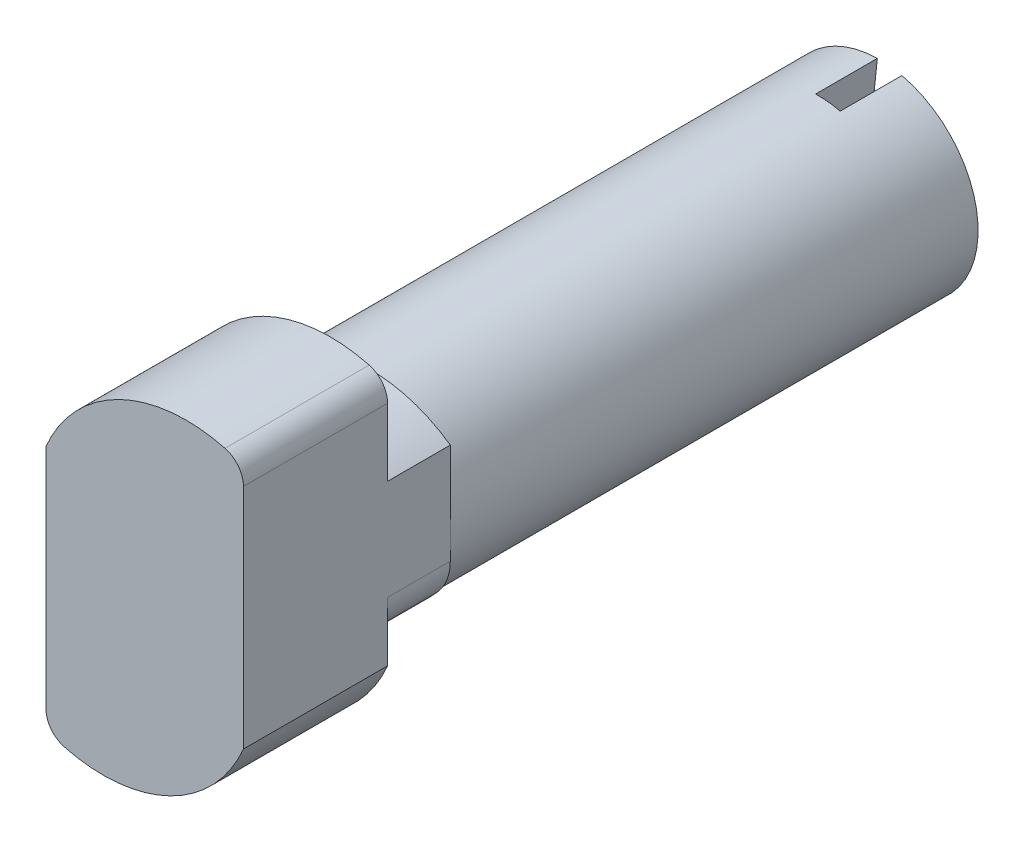
ISO-10303-21;
HEADER;
FILE_DESCRIPTION(('STEP AP214'),'2;1');
FILE_NAME('part.step','',(''),(''),'','','');
FILE_SCHEMA(('AUTOMOTIVE_DESIGN { 1 0 10303 214 1 1 1 1 }'));
ENDSEC;
DATA;
#1=APPLICATION_CONTEXT('core data for automotive mechanical design processes');
#2=APPLICATION_PROTOCOL_DEFINITION('international standard','automotive_design',2000,#1);
#3=PRODUCT_CONTEXT('',#1,'mechanical');
#4=PRODUCT('Part','Part','',(#3));
#5=PRODUCT_RELATED_PRODUCT_CATEGORY('part','',(#4));
#6=PRODUCT_DEFINITION_FORMATION('','',#4);
#7=PRODUCT_DEFINITION_CONTEXT('part definition',#1,'design');
#8=PRODUCT_DEFINITION('design','',#6,#7);
#9=PRODUCT_DEFINITION_SHAPE('','',#8);
#10=(LENGTH_UNIT() NAMED_UNIT(*) SI_UNIT(.MILLI.,.METRE.));
#11=(NAMED_UNIT(*) PLANE_ANGLE_UNIT() SI_UNIT($,.RADIAN.));
#12=(NAMED_UNIT(*) SI_UNIT($,.STERADIAN.) SOLID_ANGLE_UNIT());
#13=UNCERTAINTY_MEASURE_WITH_UNIT(LENGTH_MEASURE(1.E-05),#10,'distance_accuracy_value','');
#14=(GEOMETRIC_REPRESENTATION_CONTEXT(3) GLOBAL_UNCERTAINTY_ASSIGNED_CONTEXT((#13)) GLOBAL_UNIT_ASSIGNED_CONTEXT((#10,
#11,#12)) REPRESENTATION_CONTEXT('',''));
#15=CARTESIAN_POINT('',(0.,0.,0.));
#16=DIRECTION('',(0.,0.,1.));
#17=DIRECTION('',(1.,0.,0.));
#18=AXIS2_PLACEMENT_3D('',#15,#16,#17);
#19=CARTESIAN_POINT('',(1.68648446998917,0.889127393809731,0.));
#20=DIRECTION('',(0.,0.,1.));
#21=DIRECTION('',(1.,0.,0.));
#22=AXIS2_PLACEMENT_3D('',#19,#20,#21);
#23=CYLINDRICAL_SURFACE('',#22,6.18135093134867);
#24=CARTESIAN_POINT('',(1.68648446998917,0.889127393809731,0.));
#25=DIRECTION('',(0.,0.,1.));
#26=DIRECTION('',(1.,0.,0.));
#27=AXIS2_PLACEMENT_3D('',#24,#25,#26);
#28=CIRCLE('',#27,6.18135093134867);
#29=CARTESIAN_POINT('',(3.25350831229432,6.86855342095754,0.));
#30=VERTEX_POINT('',#29);
#31=CARTESIAN_POINT('',(-4.,3.31255342095752,0.));
#32=VERTEX_POINT('',#31);
#33=EDGE_CURVE('E220',#30,#32,#28,.T.);
#34=ORIENTED_EDGE('',*,*,#33,.T.);
#35=DIRECTION('',(0.,0.,1.));
#36=VECTOR('',#35,1.);
#37=CARTESIAN_POINT('',(-4.,3.31255342095755,0.));
#38=LINE('',#37,#36);
#39=CARTESIAN_POINT('',(-4.,3.31255342095752,5.842));
#40=VERTEX_POINT('',#39);
#41=EDGE_CURVE('E141',#40,#32,#38,.F.);
#42=ORIENTED_EDGE('',*,*,#41,.F.);
#43=CARTESIAN_POINT('',(1.68648446998917,0.889127393809731,5.842));
#44=DIRECTION('',(0.,0.,1.));
#45=DIRECTION('',(1.,0.,0.));
#46=AXIS2_PLACEMENT_3D('',#43,#44,#45);
#47=CIRCLE('',#46,6.18135093134867);
#48=CARTESIAN_POINT('',(3.25350831229432,6.86855342095753,5.842));
#49=VERTEX_POINT('',#48);
#50=EDGE_CURVE('E17',#49,#40,#47,.T.);
#51=ORIENTED_EDGE('',*,*,#50,.F.);
#52=DIRECTION('',(0.,0.,1.));
#53=VECTOR('',#52,1.);
#54=CARTESIAN_POINT('',(3.25350831229431,6.86855342095754,0.));
#55=LINE('',#54,#53);
#56=EDGE_CURVE('E138',#30,#49,#55,.T.);
#57=ORIENTED_EDGE('',*,*,#56,.F.);
#58=EDGE_LOOP('',(#34,#42,#51,#57));
#59=FACE_BOUND('',#58,.T.);
#60=ADVANCED_FACE('F14',(#59),#23,.T.);
#61=CARTESIAN_POINT('',(-3.,-5.90122021280345,0.));
#62=DIRECTION('',(0.,0.,1.));
#63=DIRECTION('',(1.,0.,0.));
#64=AXIS2_PLACEMENT_3D('',#61,#62,#63);
#65=CYLINDRICAL_SURFACE('',#64,1.);
#66=CARTESIAN_POINT('',(-3.,-5.90122021280345,0.));
#67=DIRECTION('',(0.,0.,1.));
#68=DIRECTION('',(1.,0.,0.));
#69=AXIS2_PLACEMENT_3D('',#66,#67,#68);
#70=CIRCLE('',#69,1.);
#71=CARTESIAN_POINT('',(-4.,-5.90122021280345,0.));
#72=VERTEX_POINT('',#71);
#73=CARTESIAN_POINT('',(-3.25350831229432,-6.86855342095753,0.));
#74=VERTEX_POINT('',#73);
#75=EDGE_CURVE('E214',#72,#74,#70,.T.);
#76=ORIENTED_EDGE('',*,*,#75,.T.);
#77=DIRECTION('',(0.,0.,1.));
#78=VECTOR('',#77,1.);
#79=CARTESIAN_POINT('',(-3.25350831229432,-6.86855342095751,0.));
#80=LINE('',#79,#78);
#81=CARTESIAN_POINT('',(-3.25350831229432,-6.86855342095753,5.842));
#82=VERTEX_POINT('',#81);
#83=EDGE_CURVE('E154',#82,#74,#80,.F.);
#84=ORIENTED_EDGE('',*,*,#83,.F.);
#85=CARTESIAN_POINT('',(-3.,-5.90122021280345,5.842));
#86=DIRECTION('',(0.,0.,1.));
#87=DIRECTION('',(1.,0.,0.));
#88=AXIS2_PLACEMENT_3D('',#85,#86,#87);
#89=CIRCLE('',#88,1.);
#90=CARTESIAN_POINT('',(-4.,-5.90122021280345,5.842));
#91=VERTEX_POINT('',#90);
#92=EDGE_CURVE('E145',#91,#82,#89,.T.);
#93=ORIENTED_EDGE('',*,*,#92,.F.);
#94=DIRECTION('',(0.,0.,1.));
#95=VECTOR('',#94,1.);
#96=CARTESIAN_POINT('',(-4.,-5.90122021280345,0.));
#97=LINE('',#96,#95);
#98=EDGE_CURVE('E244',#72,#91,#97,.T.);
#99=ORIENTED_EDGE('',*,*,#98,.F.);
#100=EDGE_LOOP('',(#76,#84,#93,#99));
#101=FACE_BOUND('',#100,.T.);
#102=ADVANCED_FACE('F231',(#101),#65,.T.);
#103=CARTESIAN_POINT('',(0.,0.,5.842));
#104=DIRECTION('',(0.,0.,1.));
#105=DIRECTION('',(1.,0.,0.));
#106=AXIS2_PLACEMENT_3D('',#103,#104,#105);
#107=PLANE('',#106);
#108=DIRECTION('',(0.,1.,0.));
#109=VECTOR('',#108,1.);
#110=CARTESIAN_POINT('',(4.,5.90122021280345,5.842));
#111=LINE('',#110,#109);
#112=CARTESIAN_POINT('',(4.,5.90122021280345,5.842));
#113=VERTEX_POINT('',#112);
#114=CARTESIAN_POINT('',(4.,-3.31255342095752,5.842));
#115=VERTEX_POINT('',#114);
#116=EDGE_CURVE('E150',#113,#115,#111,.F.);
#117=ORIENTED_EDGE('',*,*,#116,.F.);
#118=CARTESIAN_POINT('',(3.,5.90122021280345,5.842));
#119=DIRECTION('',(0.,0.,1.));
#120=DIRECTION('',(1.,0.,0.));
#121=AXIS2_PLACEMENT_3D('',#118,#119,#120);
#122=CIRCLE('',#121,1.);
#123=EDGE_CURVE('E147',#49,#113,#122,.F.);
#124=ORIENTED_EDGE('',*,*,#123,.F.);
#125=ORIENTED_EDGE('',*,*,#50,.T.);
#126=DIRECTION('',(0.,1.,0.));
#127=VECTOR('',#126,1.);
#128=CARTESIAN_POINT('',(-4.,-5.90122021280345,5.842));
#129=LINE('',#128,#127);
#130=EDGE_CURVE('E207',#91,#40,#129,.T.);
#131=ORIENTED_EDGE('',*,*,#130,.F.);
#132=ORIENTED_EDGE('',*,*,#92,.T.);
#133=CARTESIAN_POINT('',(-1.68648446998917,-0.889127393809732,5.842));
#134=DIRECTION('',(0.,0.,1.));
#135=DIRECTION('',(1.,0.,0.));
#136=AXIS2_PLACEMENT_3D('',#133,#134,#135);
#137=CIRCLE('',#136,6.18135093134867);
#138=EDGE_CURVE('E223',#115,#82,#137,.F.);
#139=ORIENTED_EDGE('',*,*,#138,.F.);
#140=EDGE_LOOP('',(#117,#124,#125,#131,#132,#139));
#141=FACE_BOUND('',#140,.T.);
#142=ADVANCED_FACE('F148',(#141),#107,.T.);
#143=CARTESIAN_POINT('',(-1.68648446998917,-0.889127393809732,0.));
#144=DIRECTION('',(0.,0.,1.));
#145=DIRECTION('',(1.,0.,0.));
#146=AXIS2_PLACEMENT_3D('',#143,#144,#145);
#147=CYLINDRICAL_SURFACE('',#146,6.18135093134867);
#148=CARTESIAN_POINT('',(-1.68648446998917,-0.889127393809732,0.));
#149=DIRECTION('',(0.,0.,1.));
#150=DIRECTION('',(1.,0.,0.));
#151=AXIS2_PLACEMENT_3D('',#148,#149,#150);
#152=CIRCLE('',#151,6.18135093134867);
#153=CARTESIAN_POINT('',(4.,-3.31255342095752,0.));
#154=VERTEX_POINT('',#153);
#155=EDGE_CURVE('E212',#74,#154,#152,.T.);
#156=ORIENTED_EDGE('',*,*,#155,.T.);
#157=DIRECTION('',(0.,0.,-1.));
#158=VECTOR('',#157,1.);
#159=CARTESIAN_POINT('',(4.,-3.31255342095755,0.));
#160=LINE('',#159,#158);
#161=EDGE_CURVE('E236',#115,#154,#160,.T.);
#162=ORIENTED_EDGE('',*,*,#161,.F.);
#163=ORIENTED_EDGE('',*,*,#138,.T.);
#164=ORIENTED_EDGE('',*,*,#83,.T.);
#165=EDGE_LOOP('',(#156,#162,#163,#164));
#166=FACE_BOUND('',#165,.T.);
#167=ADVANCED_FACE('F234',(#166),#147,.T.);
#168=CARTESIAN_POINT('',(3.,5.90122021280345,0.));
#169=DIRECTION('',(0.,0.,1.));
#170=DIRECTION('',(1.,0.,0.));
#171=AXIS2_PLACEMENT_3D('',#168,#169,#170);
#172=CYLINDRICAL_SURFACE('',#171,1.);
#173=CARTESIAN_POINT('',(3.,5.90122021280345,0.));
#174=DIRECTION('',(0.,0.,1.));
#175=DIRECTION('',(1.,0.,0.));
#176=AXIS2_PLACEMENT_3D('',#173,#174,#175);
#177=CIRCLE('',#176,1.);
#178=CARTESIAN_POINT('',(4.,5.90122021280345,0.));
#179=VERTEX_POINT('',#178);
#180=EDGE_CURVE('E157',#179,#30,#177,.T.);
#181=ORIENTED_EDGE('',*,*,#180,.T.);
#182=ORIENTED_EDGE('',*,*,#56,.T.);
#183=ORIENTED_EDGE('',*,*,#123,.T.);
#184=DIRECTION('',(0.,0.,-1.));
#185=VECTOR('',#184,1.);
#186=CARTESIAN_POINT('',(4.,5.90122021280345,0.));
#187=LINE('',#186,#185);
#188=EDGE_CURVE('E243',#179,#113,#187,.F.);
#189=ORIENTED_EDGE('',*,*,#188,.F.);
#190=EDGE_LOOP('',(#181,#182,#183,#189));
#191=FACE_BOUND('',#190,.T.);
#192=ADVANCED_FACE('F156',(#191),#172,.T.);
#193=CARTESIAN_POINT('',(-2.,0.908968852594026,0.));
#194=DIRECTION('',(0.,0.,-1.));
#195=DIRECTION('',(-1.,0.,0.));
#196=AXIS2_PLACEMENT_3D('',#193,#194,#195);
#197=CYLINDRICAL_SURFACE('',#196,2.);
#198=CARTESIAN_POINT('',(-2.,0.908968852594026,0.));
#199=DIRECTION('',(0.,0.,-1.));
#200=DIRECTION('',(-1.,0.,0.));
#201=AXIS2_PLACEMENT_3D('',#198,#199,#200);
#202=CIRCLE('',#201,2.);
#203=CARTESIAN_POINT('',(-4.,0.908968852594026,0.));
#204=VERTEX_POINT('',#203);
#205=CARTESIAN_POINT('',(-3.52743220326615,2.20007336595672,0.));
#206=VERTEX_POINT('',#205);
#207=EDGE_CURVE('E218',#204,#206,#202,.T.);
#208=ORIENTED_EDGE('',*,*,#207,.T.);
#209=DIRECTION('',(0.,0.,-1.));
#210=VECTOR('',#209,1.);
#211=CARTESIAN_POINT('',(-3.52743220326615,2.20007336595672,0.));
#212=LINE('',#211,#210);
#213=CARTESIAN_POINT('',(-3.52743220326615,2.20007336595672,-2.54));
#214=VERTEX_POINT('',#213);
#215=EDGE_CURVE('E204',#214,#206,#212,.F.);
#216=ORIENTED_EDGE('',*,*,#215,.F.);
#217=CARTESIAN_POINT('',(-2.,0.908968852594026,-2.54));
#218=DIRECTION('',(0.,0.,-1.));
#219=DIRECTION('',(-1.,0.,0.));
#220=AXIS2_PLACEMENT_3D('',#217,#218,#219);
#221=CIRCLE('',#220,2.);
#222=CARTESIAN_POINT('',(-4.,0.908968852594026,-2.54));
#223=VERTEX_POINT('',#222);
#224=EDGE_CURVE('E159',#214,#223,#221,.F.);
#225=ORIENTED_EDGE('',*,*,#224,.T.);
#226=DIRECTION('',(0.,0.,1.));
#227=VECTOR('',#226,1.);
#228=CARTESIAN_POINT('',(-4.,0.908968852594025,0.));
#229=LINE('',#228,#227);
#230=EDGE_CURVE('E250',#204,#223,#229,.F.);
#231=ORIENTED_EDGE('',*,*,#230,.F.);
#232=EDGE_LOOP('',(#208,#216,#225,#231));
#233=FACE_BOUND('',#232,.T.);
#234=ADVANCED_FACE('F320',(#233),#197,.T.);
#235=CARTESIAN_POINT('',(0.,0.,0.));
#236=DIRECTION('',(0.,0.,1.));
#237=DIRECTION('',(1.,0.,0.));
#238=AXIS2_PLACEMENT_3D('',#235,#236,#237);
#239=PLANE('',#238);
#240=ORIENTED_EDGE('',*,*,#207,.F.);
#241=DIRECTION('',(0.,1.,0.));
#242=VECTOR('',#241,1.);
#243=CARTESIAN_POINT('',(-4.,-5.90122021280345,0.));
#244=LINE('',#243,#242);
#245=EDGE_CURVE('E254',#32,#204,#244,.F.);
#246=ORIENTED_EDGE('',*,*,#245,.F.);
#247=ORIENTED_EDGE('',*,*,#33,.F.);
#248=ORIENTED_EDGE('',*,*,#180,.F.);
#249=DIRECTION('',(0.,1.,0.));
#250=VECTOR('',#249,1.);
#251=CARTESIAN_POINT('',(4.,5.90122021280345,0.));
#252=LINE('',#251,#250);
#253=CARTESIAN_POINT('',(4.,3.16385840391128,0.));
#254=VERTEX_POINT('',#253);
#255=EDGE_CURVE('E268',#254,#179,#252,.T.);
#256=ORIENTED_EDGE('',*,*,#255,.F.);
#257=CARTESIAN_POINT('',(0.762238861943443,-1.42589030122962,0.));
#258=DIRECTION('',(0.,0.,-1.));
#259=DIRECTION('',(-1.,0.,0.));
#260=AXIS2_PLACEMENT_3D('',#257,#258,#259);
#261=CIRCLE('',#260,5.61683989120679);
#262=EDGE_CURVE('E200',#206,#254,#261,.T.);
#263=ORIENTED_EDGE('',*,*,#262,.F.);
#264=EDGE_LOOP('',(#240,#246,#247,#248,#256,#263));
#265=FACE_BOUND('',#264,.T.);
#266=ADVANCED_FACE('F324',(#265),#239,.F.);
#267=CARTESIAN_POINT('',(2.,-0.908968852594026,0.));
#268=DIRECTION('',(0.,0.,-1.));
#269=DIRECTION('',(-1.,0.,0.));
#270=AXIS2_PLACEMENT_3D('',#267,#268,#269);
#271=CYLINDRICAL_SURFACE('',#270,2.);
#272=CARTESIAN_POINT('',(2.,-0.908968852594026,0.));
#273=DIRECTION('',(0.,0.,-1.));
#274=DIRECTION('',(-1.,0.,0.));
#275=AXIS2_PLACEMENT_3D('',#272,#273,#274);
#276=CIRCLE('',#275,2.);
#277=CARTESIAN_POINT('',(4.,-0.908968852594026,0.));
#278=VERTEX_POINT('',#277);
#279=CARTESIAN_POINT('',(3.52743220326615,-2.20007336595672,0.));
#280=VERTEX_POINT('',#279);
#281=EDGE_CURVE('E210',#278,#280,#276,.T.);
#282=ORIENTED_EDGE('',*,*,#281,.T.);
#283=DIRECTION('',(0.,0.,-1.));
#284=VECTOR('',#283,1.);
#285=CARTESIAN_POINT('',(3.52743220326615,-2.20007336595671,0.));
#286=LINE('',#285,#284);
#287=CARTESIAN_POINT('',(3.52743220326615,-2.20007336595672,-2.54));
#288=VERTEX_POINT('',#287);
#289=EDGE_CURVE('E199',#288,#280,#286,.F.);
#290=ORIENTED_EDGE('',*,*,#289,.F.);
#291=CARTESIAN_POINT('',(2.,-0.908968852594026,-2.54));
#292=DIRECTION('',(0.,0.,-1.));
#293=DIRECTION('',(-1.,0.,0.));
#294=AXIS2_PLACEMENT_3D('',#291,#292,#293);
#295=CIRCLE('',#294,2.);
#296=CARTESIAN_POINT('',(4.,-0.908968852594026,-2.54));
#297=VERTEX_POINT('',#296);
#298=EDGE_CURVE('E216',#288,#297,#295,.F.);
#299=ORIENTED_EDGE('',*,*,#298,.T.);
#300=DIRECTION('',(0.,0.,-1.));
#301=VECTOR('',#300,1.);
#302=CARTESIAN_POINT('',(4.,-0.908968852594025,0.));
#303=LINE('',#302,#301);
#304=EDGE_CURVE('E271',#278,#297,#303,.T.);
#305=ORIENTED_EDGE('',*,*,#304,.F.);
#306=EDGE_LOOP('',(#282,#290,#299,#305));
#307=FACE_BOUND('',#306,.T.);
#308=ADVANCED_FACE('F277',(#307),#271,.T.);
#309=CARTESIAN_POINT('',(0.,0.,0.));
#310=DIRECTION('',(0.,0.,1.));
#311=DIRECTION('',(1.,0.,0.));
#312=AXIS2_PLACEMENT_3D('',#309,#310,#311);
#313=PLANE('',#312);
#314=DIRECTION('',(0.,1.,0.));
#315=VECTOR('',#314,1.);
#316=CARTESIAN_POINT('',(4.,5.90122021280345,0.));
#317=LINE('',#316,#315);
#318=EDGE_CURVE('E239',#154,#278,#317,.T.);
#319=ORIENTED_EDGE('',*,*,#318,.F.);
#320=ORIENTED_EDGE('',*,*,#155,.F.);
#321=ORIENTED_EDGE('',*,*,#75,.F.);
#322=DIRECTION('',(0.,1.,0.));
#323=VECTOR('',#322,1.);
#324=CARTESIAN_POINT('',(-4.,-5.90122021280345,0.));
#325=LINE('',#324,#323);
#326=CARTESIAN_POINT('',(-4.,-3.16385840391127,0.));
#327=VERTEX_POINT('',#326);
#328=EDGE_CURVE('E246',#327,#72,#325,.F.);
#329=ORIENTED_EDGE('',*,*,#328,.F.);
#330=CARTESIAN_POINT('',(-0.762238861943445,1.42589030122963,0.));
#331=DIRECTION('',(0.,0.,-1.));
#332=DIRECTION('',(-1.,0.,0.));
#333=AXIS2_PLACEMENT_3D('',#330,#331,#332);
#334=CIRCLE('',#333,5.61683989120679);
#335=EDGE_CURVE('E195',#280,#327,#334,.T.);
#336=ORIENTED_EDGE('',*,*,#335,.F.);
#337=ORIENTED_EDGE('',*,*,#281,.F.);
#338=EDGE_LOOP('',(#319,#320,#321,#329,#336,#337));
#339=FACE_BOUND('',#338,.T.);
#340=ADVANCED_FACE('F273',(#339),#313,.F.);
#341=CARTESIAN_POINT('',(0.,0.,-21.4268));
#342=DIRECTION('',(0.,0.,1.));
#343=DIRECTION('',(1.,0.,0.));
#344=AXIS2_PLACEMENT_3D('',#341,#342,#343);
#345=PLANE('',#344);
#346=DIRECTION('',(-0.104528463267654,-0.994521895368273,0.));
#347=VECTOR('',#346,1.);
#348=CARTESIAN_POINT('',(-1.01990326402241,-4.92034524520754,-21.4268));
#349=LINE('',#348,#347);
#350=CARTESIAN_POINT('',(-0.912095425785081,-3.89462218119575,-21.4268));
#351=VERTEX_POINT('',#350);
#352=CARTESIAN_POINT('',(-0.082426469583194,3.9991506444634,-21.4268));
#353=VERTEX_POINT('',#352);
#354=EDGE_CURVE('E296',#351,#353,#349,.F.);
#355=ORIENTED_EDGE('',*,*,#354,.T.);
#356=CARTESIAN_POINT('',(0.,0.,-21.4268));
#357=DIRECTION('',(0.,0.,-1.));
#358=DIRECTION('',(-1.,0.,0.));
#359=AXIS2_PLACEMENT_3D('',#356,#357,#358);
#360=CIRCLE('',#359,4.);
#361=CARTESIAN_POINT('',(0.91209542578508,3.89462218119575,-21.4268));
#362=VERTEX_POINT('',#361);
#363=EDGE_CURVE('E208',#362,#353,#360,.F.);
#364=ORIENTED_EDGE('',*,*,#363,.F.);
#365=DIRECTION('',(0.104528463267654,0.994521895368273,0.));
#366=VECTOR('',#365,1.);
#367=CARTESIAN_POINT('',(1.01990326402241,4.92034524520754,-21.4268));
#368=LINE('',#367,#366);
#369=CARTESIAN_POINT('',(0.0824264695831945,-3.9991506444634,-21.4268));
#370=VERTEX_POINT('',#369);
#371=EDGE_CURVE('E290',#362,#370,#368,.F.);
#372=ORIENTED_EDGE('',*,*,#371,.T.);
#373=CARTESIAN_POINT('',(0.,0.,-21.4268));
#374=DIRECTION('',(0.,0.,-1.));
#375=DIRECTION('',(-1.,0.,0.));
#376=AXIS2_PLACEMENT_3D('',#373,#374,#375);
#377=CIRCLE('',#376,4.);
#378=EDGE_CURVE('E205',#351,#370,#377,.F.);
#379=ORIENTED_EDGE('',*,*,#378,.F.);
#380=EDGE_LOOP('',(#355,#364,#372,#379));
#381=FACE_BOUND('',#380,.T.);
#382=ADVANCED_FACE('F382',(#381),#345,.F.);
#383=CARTESIAN_POINT('',(-4.,-5.90122021280345,0.));
#384=DIRECTION('',(-1.,0.,0.));
#385=DIRECTION('',(0.,0.,1.));
#386=AXIS2_PLACEMENT_3D('',#383,#384,#385);
#387=PLANE('',#386);
#388=ORIENTED_EDGE('',*,*,#328,.T.);
#389=ORIENTED_EDGE('',*,*,#98,.T.);
#390=ORIENTED_EDGE('',*,*,#130,.T.);
#391=ORIENTED_EDGE('',*,*,#41,.T.);
#392=ORIENTED_EDGE('',*,*,#245,.T.);
#393=ORIENTED_EDGE('',*,*,#230,.T.);
#394=DIRECTION('',(0.,1.,0.));
#395=VECTOR('',#394,1.);
#396=CARTESIAN_POINT('',(-4.,-5.90122021280345,-2.54));
#397=LINE('',#396,#395);
#398=CARTESIAN_POINT('',(-4.,0.,-2.54));
#399=VERTEX_POINT('',#398);
#400=EDGE_CURVE('E253',#223,#399,#397,.F.);
#401=ORIENTED_EDGE('',*,*,#400,.T.);
#402=DIRECTION('',(0.,1.,0.));
#403=VECTOR('',#402,1.);
#404=CARTESIAN_POINT('',(-4.,0.,-2.54));
#405=LINE('',#404,#403);
#406=CARTESIAN_POINT('',(-4.,-3.16385840391127,-2.54));
#407=VERTEX_POINT('',#406);
#408=EDGE_CURVE('E194',#399,#407,#405,.F.);
#409=ORIENTED_EDGE('',*,*,#408,.T.);
#410=DIRECTION('',(0.,0.,-1.));
#411=VECTOR('',#410,1.);
#412=CARTESIAN_POINT('',(-4.,-3.16385840391127,0.));
#413=LINE('',#412,#411);
#414=EDGE_CURVE('E198',#327,#407,#413,.T.);
#415=ORIENTED_EDGE('',*,*,#414,.F.);
#416=EDGE_LOOP('',(#388,#389,#390,#391,#392,#393,#401,#409,#415));
#417=FACE_BOUND('',#416,.T.);
#418=ADVANCED_FACE('F259',(#417),#387,.T.);
#419=CARTESIAN_POINT('',(4.,5.90122021280345,0.));
#420=DIRECTION('',(1.,0.,0.));
#421=DIRECTION('',(0.,0.,-1.));
#422=AXIS2_PLACEMENT_3D('',#419,#420,#421);
#423=PLANE('',#422);
#424=ORIENTED_EDGE('',*,*,#255,.T.);
#425=ORIENTED_EDGE('',*,*,#188,.T.);
#426=ORIENTED_EDGE('',*,*,#116,.T.);
#427=ORIENTED_EDGE('',*,*,#161,.T.);
#428=ORIENTED_EDGE('',*,*,#318,.T.);
#429=ORIENTED_EDGE('',*,*,#304,.T.);
#430=DIRECTION('',(0.,1.,0.));
#431=VECTOR('',#430,1.);
#432=CARTESIAN_POINT('',(4.,5.90122021280345,-2.54));
#433=LINE('',#432,#431);
#434=CARTESIAN_POINT('',(4.,0.,-2.54));
#435=VERTEX_POINT('',#434);
#436=EDGE_CURVE('E32',#297,#435,#433,.T.);
#437=ORIENTED_EDGE('',*,*,#436,.T.);
#438=DIRECTION('',(0.,1.,0.));
#439=VECTOR('',#438,1.);
#440=CARTESIAN_POINT('',(4.,0.,-2.54));
#441=LINE('',#440,#439);
#442=CARTESIAN_POINT('',(4.,3.16385840391128,-2.54));
#443=VERTEX_POINT('',#442);
#444=EDGE_CURVE('E188',#435,#443,#441,.T.);
#445=ORIENTED_EDGE('',*,*,#444,.T.);
#446=DIRECTION('',(0.,0.,-1.));
#447=VECTOR('',#446,1.);
#448=CARTESIAN_POINT('',(4.,3.16385840391128,0.));
#449=LINE('',#448,#447);
#450=EDGE_CURVE('E203',#254,#443,#449,.T.);
#451=ORIENTED_EDGE('',*,*,#450,.F.);
#452=EDGE_LOOP('',(#424,#425,#426,#427,#428,#429,#437,#445,#451));
#453=FACE_BOUND('',#452,.T.);
#454=ADVANCED_FACE('F242',(#453),#423,.T.);
#455=CARTESIAN_POINT('',(0.762238861943443,-1.42589030122962,0.));
#456=DIRECTION('',(0.,0.,-1.));
#457=DIRECTION('',(-1.,0.,0.));
#458=AXIS2_PLACEMENT_3D('',#455,#456,#457);
#459=CYLINDRICAL_SURFACE('',#458,5.61683989120679);
#460=ORIENTED_EDGE('',*,*,#262,.T.);
#461=ORIENTED_EDGE('',*,*,#450,.T.);
#462=CARTESIAN_POINT('',(0.762238861943443,-1.42589030122962,-2.54));
#463=DIRECTION('',(0.,0.,-1.));
#464=DIRECTION('',(-1.,0.,0.));
#465=AXIS2_PLACEMENT_3D('',#462,#463,#464);
#466=CIRCLE('',#465,5.61683989120679);
#467=CARTESIAN_POINT('',(-1.88574976678618,3.52759802373597,-2.54));
#468=VERTEX_POINT('',#467);
#469=EDGE_CURVE('E186',#443,#468,#466,.F.);
#470=ORIENTED_EDGE('',*,*,#469,.T.);
#471=CARTESIAN_POINT('',(0.762238861943443,-1.42589030122962,-2.54));
#472=DIRECTION('',(0.,0.,-1.));
#473=DIRECTION('',(-1.,0.,0.));
#474=AXIS2_PLACEMENT_3D('',#471,#472,#473);
#475=CIRCLE('',#474,5.61683989120679);
#476=EDGE_CURVE('E189',#468,#214,#475,.F.);
#477=ORIENTED_EDGE('',*,*,#476,.T.);
#478=ORIENTED_EDGE('',*,*,#215,.T.);
#479=EDGE_LOOP('',(#460,#461,#470,#477,#478));
#480=FACE_BOUND('',#479,.T.);
#481=ADVANCED_FACE('F304',(#480),#459,.T.);
#482=CARTESIAN_POINT('',(-0.762238861943445,1.42589030122963,0.));
#483=DIRECTION('',(0.,0.,-1.));
#484=DIRECTION('',(-1.,0.,0.));
#485=AXIS2_PLACEMENT_3D('',#482,#483,#484);
#486=CYLINDRICAL_SURFACE('',#485,5.61683989120679);
#487=ORIENTED_EDGE('',*,*,#335,.T.);
#488=ORIENTED_EDGE('',*,*,#414,.T.);
#489=CARTESIAN_POINT('',(-0.762238861943445,1.42589030122963,-2.54));
#490=DIRECTION('',(0.,0.,-1.));
#491=DIRECTION('',(-1.,0.,0.));
#492=AXIS2_PLACEMENT_3D('',#489,#490,#491);
#493=CIRCLE('',#492,5.61683989120679);
#494=CARTESIAN_POINT('',(1.88574976678618,-3.52759802373597,-2.54));
#495=VERTEX_POINT('',#494);
#496=EDGE_CURVE('E192',#407,#495,#493,.F.);
#497=ORIENTED_EDGE('',*,*,#496,.T.);
#498=CARTESIAN_POINT('',(-0.762238861943445,1.42589030122963,-2.54));
#499=DIRECTION('',(0.,0.,-1.));
#500=DIRECTION('',(-1.,0.,0.));
#501=AXIS2_PLACEMENT_3D('',#498,#499,#500);
#502=CIRCLE('',#501,5.61683989120679);
#503=EDGE_CURVE('E183',#495,#288,#502,.F.);
#504=ORIENTED_EDGE('',*,*,#503,.T.);
#505=ORIENTED_EDGE('',*,*,#289,.T.);
#506=EDGE_LOOP('',(#487,#488,#497,#504,#505));
#507=FACE_BOUND('',#506,.T.);
#508=ADVANCED_FACE('F346',(#507),#486,.T.);
#509=CARTESIAN_POINT('',(0.,0.,-23.9268));
#510=DIRECTION('',(0.,0.,1.));
#511=DIRECTION('',(1.,0.,0.));
#512=AXIS2_PLACEMENT_3D('',#509,#510,#511);
#513=PLANE('',#512);
#514=CARTESIAN_POINT('',(0.,0.,-23.9268));
#515=DIRECTION('',(0.,0.,-1.));
#516=DIRECTION('',(-1.,0.,0.));
#517=AXIS2_PLACEMENT_3D('',#514,#515,#516);
#518=CIRCLE('',#517,4.);
#519=CARTESIAN_POINT('',(0.0824264695831945,-3.9991506444634,-23.9268));
#520=VERTEX_POINT('',#519);
#521=CARTESIAN_POINT('',(0.91209542578508,3.89462218119575,-23.9268));
#522=VERTEX_POINT('',#521);
#523=EDGE_CURVE('E178',#520,#522,#518,.F.);
#524=ORIENTED_EDGE('',*,*,#523,.F.);
#525=DIRECTION('',(0.104528463267654,0.994521895368273,0.));
#526=VECTOR('',#525,1.);
#527=CARTESIAN_POINT('',(1.01990326402241,4.92034524520754,-23.9268));
#528=LINE('',#527,#526);
#529=EDGE_CURVE('E287',#520,#522,#528,.T.);
#530=ORIENTED_EDGE('',*,*,#529,.T.);
#531=EDGE_LOOP('',(#524,#530));
#532=FACE_BOUND('',#531,.T.);
#533=ADVANCED_FACE('F344',(#532),#513,.F.);
#534=CARTESIAN_POINT('',(1.01990326402241,4.92034524520754,-23.9268));
#535=DIRECTION('',(0.994521895368273,-0.104528463267654,0.));
#536=DIRECTION('',(0.104528463267654,0.994521895368273,0.));
#537=AXIS2_PLACEMENT_3D('',#534,#535,#536);
#538=PLANE('',#537);
#539=ORIENTED_EDGE('',*,*,#371,.F.);
#540=DIRECTION('',(0.,0.,-1.));
#541=VECTOR('',#540,1.);
#542=CARTESIAN_POINT('',(0.91209542578508,3.89462218119575,-2.54));
#543=LINE('',#542,#541);
#544=EDGE_CURVE('E181',#522,#362,#543,.F.);
#545=ORIENTED_EDGE('',*,*,#544,.F.);
#546=ORIENTED_EDGE('',*,*,#529,.F.);
#547=DIRECTION('',(0.,0.,-1.));
#548=VECTOR('',#547,1.);
#549=CARTESIAN_POINT('',(0.0824264695831972,-3.9991506444634,-2.54));
#550=LINE('',#549,#548);
#551=EDGE_CURVE('E182',#370,#520,#550,.T.);
#552=ORIENTED_EDGE('',*,*,#551,.F.);
#553=EDGE_LOOP('',(#539,#545,#546,#552));
#554=FACE_BOUND('',#553,.T.);
#555=ADVANCED_FACE('F343',(#554),#538,.F.);
#556=CARTESIAN_POINT('',(0.,0.,-23.9268));
#557=DIRECTION('',(0.,0.,1.));
#558=DIRECTION('',(1.,0.,0.));
#559=AXIS2_PLACEMENT_3D('',#556,#557,#558);
#560=PLANE('',#559);
#561=CARTESIAN_POINT('',(0.,0.,-23.9268));
#562=DIRECTION('',(0.,0.,-1.));
#563=DIRECTION('',(-1.,0.,0.));
#564=AXIS2_PLACEMENT_3D('',#561,#562,#563);
#565=CIRCLE('',#564,4.);
#566=CARTESIAN_POINT('',(-0.082426469583194,3.9991506444634,-23.9268));
#567=VERTEX_POINT('',#566);
#568=CARTESIAN_POINT('',(-0.912095425785081,-3.89462218119575,-23.9268));
#569=VERTEX_POINT('',#568);
#570=EDGE_CURVE('E174',#567,#569,#565,.F.);
#571=ORIENTED_EDGE('',*,*,#570,.F.);
#572=DIRECTION('',(-0.104528463267654,-0.994521895368273,0.));
#573=VECTOR('',#572,1.);
#574=CARTESIAN_POINT('',(-1.01990326402241,-4.92034524520754,-23.9268));
#575=LINE('',#574,#573);
#576=EDGE_CURVE('E328',#567,#569,#575,.T.);
#577=ORIENTED_EDGE('',*,*,#576,.T.);
#578=EDGE_LOOP('',(#571,#577));
#579=FACE_BOUND('',#578,.T.);
#580=ADVANCED_FACE('F353',(#579),#560,.F.);
#581=CARTESIAN_POINT('',(-1.01990326402241,-4.92034524520754,-23.9268));
#582=DIRECTION('',(-0.994521895368273,0.104528463267654,0.));
#583=DIRECTION('',(-0.104528463267654,-0.994521895368273,0.));
#584=AXIS2_PLACEMENT_3D('',#581,#582,#583);
#585=PLANE('',#584);
#586=ORIENTED_EDGE('',*,*,#576,.F.);
#587=DIRECTION('',(0.,0.,-1.));
#588=VECTOR('',#587,1.);
#589=CARTESIAN_POINT('',(-0.0824264695831941,3.9991506444634,-2.54));
#590=LINE('',#589,#588);
#591=EDGE_CURVE('E177',#353,#567,#590,.T.);
#592=ORIENTED_EDGE('',*,*,#591,.F.);
#593=ORIENTED_EDGE('',*,*,#354,.F.);
#594=DIRECTION('',(0.,0.,-1.));
#595=VECTOR('',#594,1.);
#596=CARTESIAN_POINT('',(-0.91209542578508,-3.89462218119575,-2.54));
#597=LINE('',#596,#595);
#598=EDGE_CURVE('E173',#569,#351,#597,.F.);
#599=ORIENTED_EDGE('',*,*,#598,.F.);
#600=EDGE_LOOP('',(#586,#592,#593,#599));
#601=FACE_BOUND('',#600,.T.);
#602=ADVANCED_FACE('F369',(#601),#585,.F.);
#603=CARTESIAN_POINT('',(0.,0.,-2.54));
#604=DIRECTION('',(0.,0.,1.));
#605=DIRECTION('',(1.,0.,0.));
#606=AXIS2_PLACEMENT_3D('',#603,#604,#605);
#607=PLANE('',#606);
#608=ORIENTED_EDGE('',*,*,#496,.F.);
#609=ORIENTED_EDGE('',*,*,#408,.F.);
#610=CARTESIAN_POINT('',(0.,0.,-2.54));
#611=DIRECTION('',(0.,0.,-1.));
#612=DIRECTION('',(-1.,0.,0.));
#613=AXIS2_PLACEMENT_3D('',#610,#611,#612);
#614=CIRCLE('',#613,4.);
#615=EDGE_CURVE('E170',#495,#399,#614,.T.);
#616=ORIENTED_EDGE('',*,*,#615,.F.);
#617=EDGE_LOOP('',(#608,#609,#616));
#618=FACE_BOUND('',#617,.T.);
#619=ADVANCED_FACE('F327',(#618),#607,.F.);
#620=CARTESIAN_POINT('',(0.,0.,-2.54));
#621=DIRECTION('',(0.,0.,1.));
#622=DIRECTION('',(1.,0.,0.));
#623=AXIS2_PLACEMENT_3D('',#620,#621,#622);
#624=PLANE('',#623);
#625=ORIENTED_EDGE('',*,*,#400,.F.);
#626=ORIENTED_EDGE('',*,*,#224,.F.);
#627=ORIENTED_EDGE('',*,*,#476,.F.);
#628=CARTESIAN_POINT('',(0.,0.,-2.54));
#629=DIRECTION('',(0.,0.,-1.));
#630=DIRECTION('',(-1.,0.,0.));
#631=AXIS2_PLACEMENT_3D('',#628,#629,#630);
#632=CIRCLE('',#631,4.);
#633=EDGE_CURVE('E167',#399,#468,#632,.T.);
#634=ORIENTED_EDGE('',*,*,#633,.F.);
#635=EDGE_LOOP('',(#625,#626,#627,#634));
#636=FACE_BOUND('',#635,.T.);
#637=ADVANCED_FACE('F317',(#636),#624,.F.);
#638=CARTESIAN_POINT('',(0.,0.,-2.54));
#639=DIRECTION('',(0.,0.,1.));
#640=DIRECTION('',(1.,0.,0.));
#641=AXIS2_PLACEMENT_3D('',#638,#639,#640);
#642=PLANE('',#641);
#643=ORIENTED_EDGE('',*,*,#469,.F.);
#644=ORIENTED_EDGE('',*,*,#444,.F.);
#645=CARTESIAN_POINT('',(0.,0.,-2.54));
#646=DIRECTION('',(0.,0.,-1.));
#647=DIRECTION('',(-1.,0.,0.));
#648=AXIS2_PLACEMENT_3D('',#645,#646,#647);
#649=CIRCLE('',#648,4.);
#650=EDGE_CURVE('E23',#468,#435,#649,.T.);
#651=ORIENTED_EDGE('',*,*,#650,.F.);
#652=EDGE_LOOP('',(#643,#644,#651));
#653=FACE_BOUND('',#652,.T.);
#654=ADVANCED_FACE('F309',(#653),#642,.F.);
#655=CARTESIAN_POINT('',(0.,0.,-2.54));
#656=DIRECTION('',(0.,0.,1.));
#657=DIRECTION('',(1.,0.,0.));
#658=AXIS2_PLACEMENT_3D('',#655,#656,#657);
#659=PLANE('',#658);
#660=ORIENTED_EDGE('',*,*,#436,.F.);
#661=ORIENTED_EDGE('',*,*,#298,.F.);
#662=ORIENTED_EDGE('',*,*,#503,.F.);
#663=CARTESIAN_POINT('',(0.,0.,-2.54));
#664=DIRECTION('',(0.,0.,-1.));
#665=DIRECTION('',(-1.,0.,0.));
#666=AXIS2_PLACEMENT_3D('',#663,#664,#665);
#667=CIRCLE('',#666,4.);
#668=EDGE_CURVE('E9',#435,#495,#667,.T.);
#669=ORIENTED_EDGE('',*,*,#668,.F.);
#670=EDGE_LOOP('',(#660,#661,#662,#669));
#671=FACE_BOUND('',#670,.T.);
#672=ADVANCED_FACE('F281',(#671),#659,.F.);
#673=CARTESIAN_POINT('',(0.,0.,-2.54));
#674=DIRECTION('',(0.,0.,-1.));
#675=DIRECTION('',(-1.,0.,0.));
#676=AXIS2_PLACEMENT_3D('',#673,#674,#675);
#677=CYLINDRICAL_SURFACE('',#676,4.);
#678=ORIENTED_EDGE('',*,*,#650,.T.);
#679=ORIENTED_EDGE('',*,*,#668,.T.);
#680=ORIENTED_EDGE('',*,*,#615,.T.);
#681=ORIENTED_EDGE('',*,*,#633,.T.);
#682=EDGE_LOOP('',(#678,#679,#680,#681));
#683=FACE_BOUND('',#682,.T.);
#684=ORIENTED_EDGE('',*,*,#598,.T.);
#685=ORIENTED_EDGE('',*,*,#378,.T.);
#686=ORIENTED_EDGE('',*,*,#551,.T.);
#687=ORIENTED_EDGE('',*,*,#523,.T.);
#688=ORIENTED_EDGE('',*,*,#544,.T.);
#689=ORIENTED_EDGE('',*,*,#363,.T.);
#690=ORIENTED_EDGE('',*,*,#591,.T.);
#691=ORIENTED_EDGE('',*,*,#570,.T.);
#692=EDGE_LOOP('',(#684,#685,#686,#687,#688,#689,#690,#691));
#693=FACE_BOUND('',#692,.T.);
#694=ADVANCED_FACE('F312',(#683,#693),#677,.T.);
#695=CLOSED_SHELL('',(#60,#102,#142,#167,#192,#234,#266,#308,#340,#382,#418,#454,#481,#508,#533,
#555,#580,#602,#619,#637,#654,#672,#694));
#696=MANIFOLD_SOLID_BREP('B1',#695);
#697=ADVANCED_BREP_SHAPE_REPRESENTATION('',(#18,#696),#14);
#698=SHAPE_DEFINITION_REPRESENTATION(#9,#697);
ENDSEC;
END-ISO-10303-21;
